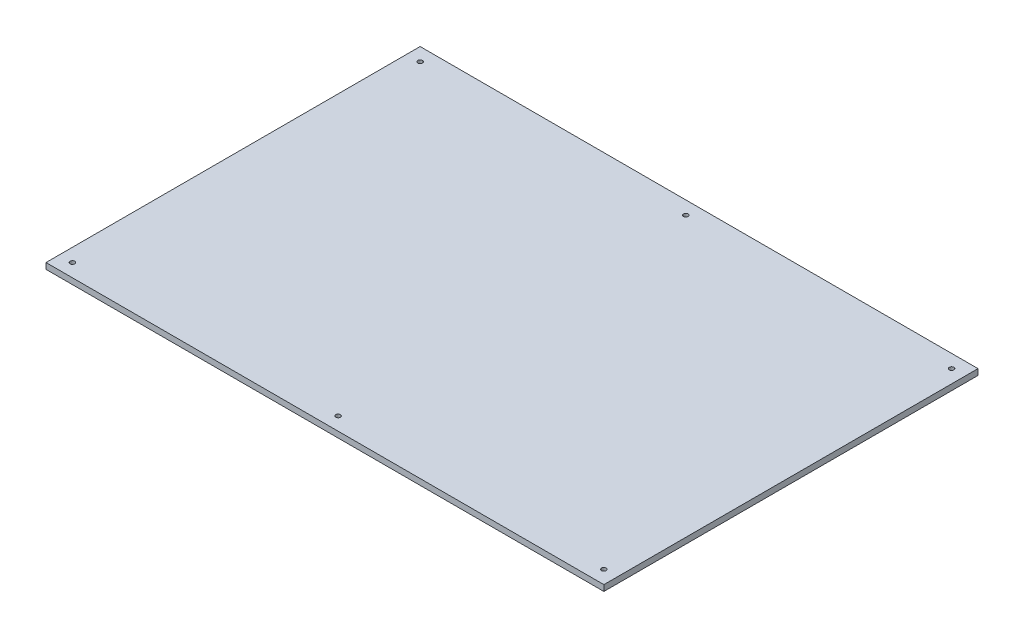
ISO-10303-21;
HEADER;
FILE_DESCRIPTION(('STEP AP214'),'2;1');
FILE_NAME('part.step','',(''),(''),'','','');
FILE_SCHEMA(('AUTOMOTIVE_DESIGN { 1 0 10303 214 1 1 1 1 }'));
ENDSEC;
DATA;
#1=APPLICATION_CONTEXT('core data for automotive mechanical design processes');
#2=APPLICATION_PROTOCOL_DEFINITION('international standard','automotive_design',2000,#1);
#3=PRODUCT_CONTEXT('',#1,'mechanical');
#4=PRODUCT('Part','Part','',(#3));
#5=PRODUCT_RELATED_PRODUCT_CATEGORY('part','',(#4));
#6=PRODUCT_DEFINITION_FORMATION('','',#4);
#7=PRODUCT_DEFINITION_CONTEXT('part definition',#1,'design');
#8=PRODUCT_DEFINITION('design','',#6,#7);
#9=PRODUCT_DEFINITION_SHAPE('','',#8);
#10=(LENGTH_UNIT() NAMED_UNIT(*) SI_UNIT(.MILLI.,.METRE.));
#11=(NAMED_UNIT(*) PLANE_ANGLE_UNIT() SI_UNIT($,.RADIAN.));
#12=(NAMED_UNIT(*) SI_UNIT($,.STERADIAN.) SOLID_ANGLE_UNIT());
#13=UNCERTAINTY_MEASURE_WITH_UNIT(LENGTH_MEASURE(1.E-05),#10,'distance_accuracy_value','');
#14=(GEOMETRIC_REPRESENTATION_CONTEXT(3) GLOBAL_UNCERTAINTY_ASSIGNED_CONTEXT((#13)) GLOBAL_UNIT_ASSIGNED_CONTEXT((#10,
#11,#12)) REPRESENTATION_CONTEXT('',''));
#15=CARTESIAN_POINT('',(0.,0.,0.));
#16=DIRECTION('',(0.,0.,1.));
#17=DIRECTION('',(1.,0.,0.));
#18=AXIS2_PLACEMENT_3D('',#15,#16,#17);
#19=CARTESIAN_POINT('',(0.,4.5,0.));
#20=DIRECTION('',(0.,1.,0.));
#21=DIRECTION('',(0.,0.,1.));
#22=AXIS2_PLACEMENT_3D('',#19,#20,#21);
#23=PLANE('',#22);
#24=CARTESIAN_POINT('',(201.,4.5,-131.5));
#25=DIRECTION('',(0.,-1.,0.));
#26=DIRECTION('',(0.,0.,1.));
#27=AXIS2_PLACEMENT_3D('',#24,#25,#26);
#28=CIRCLE('',#27,1.75000000000001);
#29=CARTESIAN_POINT('',(201.,4.5,-129.75));
#30=VERTEX_POINT('',#29);
#31=EDGE_CURVE('E138',#30,#30,#28,.T.);
#32=ORIENTED_EDGE('',*,*,#31,.T.);
#33=EDGE_LOOP('',(#32));
#34=FACE_BOUND('',#33,.T.);
#35=CARTESIAN_POINT('',(-201.,4.5,-131.5));
#36=DIRECTION('',(0.,1.,0.));
#37=DIRECTION('',(0.,0.,1.));
#38=AXIS2_PLACEMENT_3D('',#35,#36,#37);
#39=CIRCLE('',#38,1.75000000000001);
#40=CARTESIAN_POINT('',(-201.,4.5,-129.75));
#41=VERTEX_POINT('',#40);
#42=EDGE_CURVE('E133',#41,#41,#39,.T.);
#43=ORIENTED_EDGE('',*,*,#42,.F.);
#44=EDGE_LOOP('',(#43));
#45=FACE_BOUND('',#44,.T.);
#46=CARTESIAN_POINT('',(0.,4.5,-131.5));
#47=DIRECTION('',(0.,1.,0.));
#48=DIRECTION('',(0.,0.,1.));
#49=AXIS2_PLACEMENT_3D('',#46,#47,#48);
#50=CIRCLE('',#49,1.75);
#51=CARTESIAN_POINT('',(0.,4.5,-129.75));
#52=VERTEX_POINT('',#51);
#53=EDGE_CURVE('E134',#52,#52,#50,.T.);
#54=ORIENTED_EDGE('',*,*,#53,.F.);
#55=EDGE_LOOP('',(#54));
#56=FACE_BOUND('',#55,.T.);
#57=DIRECTION('',(0.,0.,1.));
#58=VECTOR('',#57,1.);
#59=CARTESIAN_POINT('',(-211.,4.5,141.5));
#60=LINE('',#59,#58);
#61=CARTESIAN_POINT('',(-211.,4.5,-141.5));
#62=VERTEX_POINT('',#61);
#63=CARTESIAN_POINT('',(-211.,4.5,141.5));
#64=VERTEX_POINT('',#63);
#65=EDGE_CURVE('E91',#62,#64,#60,.T.);
#66=ORIENTED_EDGE('',*,*,#65,.T.);
#67=DIRECTION('',(1.,0.,0.));
#68=VECTOR('',#67,1.);
#69=CARTESIAN_POINT('',(211.,4.5,141.5));
#70=LINE('',#69,#68);
#71=CARTESIAN_POINT('',(211.,4.5,141.5));
#72=VERTEX_POINT('',#71);
#73=EDGE_CURVE('E86',#64,#72,#70,.T.);
#74=ORIENTED_EDGE('',*,*,#73,.T.);
#75=DIRECTION('',(0.,0.,-1.));
#76=VECTOR('',#75,1.);
#77=CARTESIAN_POINT('',(211.,4.5,141.5));
#78=LINE('',#77,#76);
#79=CARTESIAN_POINT('',(211.,4.5,-141.5));
#80=VERTEX_POINT('',#79);
#81=EDGE_CURVE('E89',#72,#80,#78,.T.);
#82=ORIENTED_EDGE('',*,*,#81,.T.);
#83=DIRECTION('',(-1.,0.,0.));
#84=VECTOR('',#83,1.);
#85=CARTESIAN_POINT('',(211.,4.5,-141.5));
#86=LINE('',#85,#84);
#87=EDGE_CURVE('E56',#80,#62,#86,.T.);
#88=ORIENTED_EDGE('',*,*,#87,.T.);
#89=EDGE_LOOP('',(#66,#74,#82,#88));
#90=FACE_BOUND('',#89,.T.);
#91=CARTESIAN_POINT('',(0.,4.5,131.5));
#92=DIRECTION('',(0.,1.,0.));
#93=DIRECTION('',(0.,0.,-1.));
#94=AXIS2_PLACEMENT_3D('',#91,#92,#93);
#95=CIRCLE('',#94,1.75);
#96=CARTESIAN_POINT('',(0.,4.5,129.75));
#97=VERTEX_POINT('',#96);
#98=EDGE_CURVE('E158',#97,#97,#95,.T.);
#99=ORIENTED_EDGE('',*,*,#98,.F.);
#100=EDGE_LOOP('',(#99));
#101=FACE_BOUND('',#100,.T.);
#102=CARTESIAN_POINT('',(201.,4.5,131.5));
#103=DIRECTION('',(0.,1.,0.));
#104=DIRECTION('',(0.,0.,-1.));
#105=AXIS2_PLACEMENT_3D('',#102,#103,#104);
#106=CIRCLE('',#105,1.75000000000001);
#107=CARTESIAN_POINT('',(201.,4.5,129.75));
#108=VERTEX_POINT('',#107);
#109=EDGE_CURVE('E157',#108,#108,#106,.T.);
#110=ORIENTED_EDGE('',*,*,#109,.F.);
#111=EDGE_LOOP('',(#110));
#112=FACE_BOUND('',#111,.T.);
#113=CARTESIAN_POINT('',(-201.,4.5,131.5));
#114=DIRECTION('',(0.,-1.,0.));
#115=DIRECTION('',(0.,0.,-1.));
#116=AXIS2_PLACEMENT_3D('',#113,#114,#115);
#117=CIRCLE('',#116,1.75000000000001);
#118=CARTESIAN_POINT('',(-201.,4.5,129.75));
#119=VERTEX_POINT('',#118);
#120=EDGE_CURVE('E162',#119,#119,#117,.T.);
#121=ORIENTED_EDGE('',*,*,#120,.T.);
#122=EDGE_LOOP('',(#121));
#123=FACE_BOUND('',#122,.T.);
#124=ADVANCED_FACE('F38',(#34,#45,#56,#90,#101,#112,#123),#23,.T.);
#125=CARTESIAN_POINT('',(0.,0.,0.));
#126=DIRECTION('',(0.,1.,0.));
#127=DIRECTION('',(0.,0.,1.));
#128=AXIS2_PLACEMENT_3D('',#125,#126,#127);
#129=PLANE('',#128);
#130=CARTESIAN_POINT('',(201.,0.,131.5));
#131=DIRECTION('',(0.,1.,0.));
#132=DIRECTION('',(0.,0.,1.));
#133=AXIS2_PLACEMENT_3D('',#130,#131,#132);
#134=CIRCLE('',#133,1.75000000000001);
#135=CARTESIAN_POINT('',(201.,0.,133.25));
#136=VERTEX_POINT('',#135);
#137=EDGE_CURVE('E149',#136,#136,#134,.F.);
#138=ORIENTED_EDGE('',*,*,#137,.F.);
#139=EDGE_LOOP('',(#138));
#140=FACE_BOUND('',#139,.T.);
#141=CARTESIAN_POINT('',(0.,0.,131.5));
#142=DIRECTION('',(0.,1.,0.));
#143=DIRECTION('',(0.,0.,1.));
#144=AXIS2_PLACEMENT_3D('',#141,#142,#143);
#145=CIRCLE('',#144,1.75);
#146=CARTESIAN_POINT('',(0.,0.,133.25));
#147=VERTEX_POINT('',#146);
#148=EDGE_CURVE('E153',#147,#147,#145,.F.);
#149=ORIENTED_EDGE('',*,*,#148,.F.);
#150=EDGE_LOOP('',(#149));
#151=FACE_BOUND('',#150,.T.);
#152=CARTESIAN_POINT('',(-201.,0.,-131.5));
#153=DIRECTION('',(0.,1.,0.));
#154=DIRECTION('',(0.,0.,1.));
#155=AXIS2_PLACEMENT_3D('',#152,#153,#154);
#156=CIRCLE('',#155,1.75000000000001);
#157=CARTESIAN_POINT('',(-201.,0.,-129.75));
#158=VERTEX_POINT('',#157);
#159=EDGE_CURVE('E111',#158,#158,#156,.F.);
#160=ORIENTED_EDGE('',*,*,#159,.F.);
#161=EDGE_LOOP('',(#160));
#162=FACE_BOUND('',#161,.T.);
#163=CARTESIAN_POINT('',(0.,0.,-131.5));
#164=DIRECTION('',(0.,1.,0.));
#165=DIRECTION('',(0.,0.,1.));
#166=AXIS2_PLACEMENT_3D('',#163,#164,#165);
#167=CIRCLE('',#166,1.75);
#168=CARTESIAN_POINT('',(0.,0.,-129.75));
#169=VERTEX_POINT('',#168);
#170=EDGE_CURVE('E129',#169,#169,#167,.F.);
#171=ORIENTED_EDGE('',*,*,#170,.F.);
#172=EDGE_LOOP('',(#171));
#173=FACE_BOUND('',#172,.T.);
#174=DIRECTION('',(0.,0.,1.));
#175=VECTOR('',#174,1.);
#176=CARTESIAN_POINT('',(-211.,0.,141.5));
#177=LINE('',#176,#175);
#178=CARTESIAN_POINT('',(-211.,0.,-141.5));
#179=VERTEX_POINT('',#178);
#180=CARTESIAN_POINT('',(-211.,0.,141.5));
#181=VERTEX_POINT('',#180);
#182=EDGE_CURVE('E107',#179,#181,#177,.T.);
#183=ORIENTED_EDGE('',*,*,#182,.F.);
#184=DIRECTION('',(-1.,0.,0.));
#185=VECTOR('',#184,1.);
#186=CARTESIAN_POINT('',(211.,0.,-141.5));
#187=LINE('',#186,#185);
#188=CARTESIAN_POINT('',(211.,0.,-141.5));
#189=VERTEX_POINT('',#188);
#190=EDGE_CURVE('E79',#189,#179,#187,.T.);
#191=ORIENTED_EDGE('',*,*,#190,.F.);
#192=DIRECTION('',(0.,0.,-1.));
#193=VECTOR('',#192,1.);
#194=CARTESIAN_POINT('',(211.,0.,141.5));
#195=LINE('',#194,#193);
#196=CARTESIAN_POINT('',(211.,0.,141.5));
#197=VERTEX_POINT('',#196);
#198=EDGE_CURVE('E73',#197,#189,#195,.T.);
#199=ORIENTED_EDGE('',*,*,#198,.F.);
#200=DIRECTION('',(1.,0.,0.));
#201=VECTOR('',#200,1.);
#202=CARTESIAN_POINT('',(211.,0.,141.5));
#203=LINE('',#202,#201);
#204=EDGE_CURVE('E96',#181,#197,#203,.T.);
#205=ORIENTED_EDGE('',*,*,#204,.F.);
#206=EDGE_LOOP('',(#183,#191,#199,#205));
#207=FACE_BOUND('',#206,.T.);
#208=CARTESIAN_POINT('',(201.,0.,-131.5));
#209=DIRECTION('',(0.,1.,0.));
#210=DIRECTION('',(0.,0.,1.));
#211=AXIS2_PLACEMENT_3D('',#208,#209,#210);
#212=CIRCLE('',#211,1.75000000000001);
#213=CARTESIAN_POINT('',(201.,0.,-129.75));
#214=VERTEX_POINT('',#213);
#215=EDGE_CURVE('E145',#214,#214,#212,.T.);
#216=ORIENTED_EDGE('',*,*,#215,.T.);
#217=EDGE_LOOP('',(#216));
#218=FACE_BOUND('',#217,.T.);
#219=CARTESIAN_POINT('',(-201.,0.,131.5));
#220=DIRECTION('',(0.,1.,0.));
#221=DIRECTION('',(0.,0.,1.));
#222=AXIS2_PLACEMENT_3D('',#219,#220,#221);
#223=CIRCLE('',#222,1.75000000000001);
#224=CARTESIAN_POINT('',(-201.,0.,133.25));
#225=VERTEX_POINT('',#224);
#226=EDGE_CURVE('E169',#225,#225,#223,.T.);
#227=ORIENTED_EDGE('',*,*,#226,.T.);
#228=EDGE_LOOP('',(#227));
#229=FACE_BOUND('',#228,.T.);
#230=ADVANCED_FACE('F124',(#140,#151,#162,#173,#207,#218,#229),#129,.F.);
#231=CARTESIAN_POINT('',(-211.,4.5,141.5));
#232=DIRECTION('',(1.,0.,0.));
#233=DIRECTION('',(0.,0.,-1.));
#234=AXIS2_PLACEMENT_3D('',#231,#232,#233);
#235=PLANE('',#234);
#236=ORIENTED_EDGE('',*,*,#182,.T.);
#237=DIRECTION('',(0.,-1.,0.));
#238=VECTOR('',#237,1.);
#239=CARTESIAN_POINT('',(-211.,4.5,141.5));
#240=LINE('',#239,#238);
#241=EDGE_CURVE('E11',#64,#181,#240,.T.);
#242=ORIENTED_EDGE('',*,*,#241,.F.);
#243=ORIENTED_EDGE('',*,*,#65,.F.);
#244=DIRECTION('',(0.,-1.,0.));
#245=VECTOR('',#244,1.);
#246=CARTESIAN_POINT('',(-211.,4.5,-141.5));
#247=LINE('',#246,#245);
#248=EDGE_CURVE('E103',#62,#179,#247,.T.);
#249=ORIENTED_EDGE('',*,*,#248,.T.);
#250=EDGE_LOOP('',(#236,#242,#243,#249));
#251=FACE_BOUND('',#250,.T.);
#252=ADVANCED_FACE('F40',(#251),#235,.F.);
#253=CARTESIAN_POINT('',(211.,4.5,141.5));
#254=DIRECTION('',(0.,0.,-1.));
#255=DIRECTION('',(-1.,0.,0.));
#256=AXIS2_PLACEMENT_3D('',#253,#254,#255);
#257=PLANE('',#256);
#258=ORIENTED_EDGE('',*,*,#204,.T.);
#259=DIRECTION('',(0.,-1.,0.));
#260=VECTOR('',#259,1.);
#261=CARTESIAN_POINT('',(211.,4.5,141.5));
#262=LINE('',#261,#260);
#263=EDGE_CURVE('E48',#72,#197,#262,.T.);
#264=ORIENTED_EDGE('',*,*,#263,.F.);
#265=ORIENTED_EDGE('',*,*,#73,.F.);
#266=ORIENTED_EDGE('',*,*,#241,.T.);
#267=EDGE_LOOP('',(#258,#264,#265,#266));
#268=FACE_BOUND('',#267,.T.);
#269=ADVANCED_FACE('F95',(#268),#257,.F.);
#270=CARTESIAN_POINT('',(211.,4.5,141.5));
#271=DIRECTION('',(-1.,0.,0.));
#272=DIRECTION('',(0.,0.,1.));
#273=AXIS2_PLACEMENT_3D('',#270,#271,#272);
#274=PLANE('',#273);
#275=ORIENTED_EDGE('',*,*,#198,.T.);
#276=DIRECTION('',(0.,-1.,0.));
#277=VECTOR('',#276,1.);
#278=CARTESIAN_POINT('',(211.,4.5,-141.5));
#279=LINE('',#278,#277);
#280=EDGE_CURVE('E98',#80,#189,#279,.T.);
#281=ORIENTED_EDGE('',*,*,#280,.F.);
#282=ORIENTED_EDGE('',*,*,#81,.F.);
#283=ORIENTED_EDGE('',*,*,#263,.T.);
#284=EDGE_LOOP('',(#275,#281,#282,#283));
#285=FACE_BOUND('',#284,.T.);
#286=ADVANCED_FACE('F99',(#285),#274,.F.);
#287=CARTESIAN_POINT('',(211.,4.5,-141.5));
#288=DIRECTION('',(0.,0.,1.));
#289=DIRECTION('',(1.,0.,0.));
#290=AXIS2_PLACEMENT_3D('',#287,#288,#289);
#291=PLANE('',#290);
#292=ORIENTED_EDGE('',*,*,#190,.T.);
#293=ORIENTED_EDGE('',*,*,#248,.F.);
#294=ORIENTED_EDGE('',*,*,#87,.F.);
#295=ORIENTED_EDGE('',*,*,#280,.T.);
#296=EDGE_LOOP('',(#292,#293,#294,#295));
#297=FACE_BOUND('',#296,.T.);
#298=ADVANCED_FACE('F121',(#297),#291,.F.);
#299=CARTESIAN_POINT('',(0.,-0.00100000000000013,-131.5));
#300=DIRECTION('',(0.,1.,0.));
#301=DIRECTION('',(0.,0.,1.));
#302=AXIS2_PLACEMENT_3D('',#299,#300,#301);
#303=CYLINDRICAL_SURFACE('',#302,1.75);
#304=ORIENTED_EDGE('',*,*,#53,.T.);
#305=EDGE_LOOP('',(#304));
#306=FACE_BOUND('',#305,.T.);
#307=ORIENTED_EDGE('',*,*,#170,.T.);
#308=EDGE_LOOP('',(#307));
#309=FACE_BOUND('',#308,.T.);
#310=ADVANCED_FACE('F201',(#306,#309),#303,.F.);
#311=CARTESIAN_POINT('',(-201.,-0.00100000000000013,-131.5));
#312=DIRECTION('',(0.,1.,0.));
#313=DIRECTION('',(0.,0.,1.));
#314=AXIS2_PLACEMENT_3D('',#311,#312,#313);
#315=CYLINDRICAL_SURFACE('',#314,1.75000000000001);
#316=ORIENTED_EDGE('',*,*,#42,.T.);
#317=EDGE_LOOP('',(#316));
#318=FACE_BOUND('',#317,.T.);
#319=ORIENTED_EDGE('',*,*,#159,.T.);
#320=EDGE_LOOP('',(#319));
#321=FACE_BOUND('',#320,.T.);
#322=ADVANCED_FACE('F235',(#318,#321),#315,.F.);
#323=CARTESIAN_POINT('',(201.,-0.00100000000000013,-131.5));
#324=DIRECTION('',(0.,1.,0.));
#325=DIRECTION('',(0.,0.,1.));
#326=AXIS2_PLACEMENT_3D('',#323,#324,#325);
#327=CYLINDRICAL_SURFACE('',#326,1.75000000000001);
#328=ORIENTED_EDGE('',*,*,#31,.F.);
#329=EDGE_LOOP('',(#328));
#330=FACE_BOUND('',#329,.T.);
#331=ORIENTED_EDGE('',*,*,#215,.F.);
#332=EDGE_LOOP('',(#331));
#333=FACE_BOUND('',#332,.T.);
#334=ADVANCED_FACE('F242',(#330,#333),#327,.F.);
#335=CARTESIAN_POINT('',(0.,-0.00100000000000013,131.5));
#336=DIRECTION('',(0.,1.,0.));
#337=DIRECTION('',(0.,0.,1.));
#338=AXIS2_PLACEMENT_3D('',#335,#336,#337);
#339=CYLINDRICAL_SURFACE('',#338,1.75);
#340=ORIENTED_EDGE('',*,*,#98,.T.);
#341=EDGE_LOOP('',(#340));
#342=FACE_BOUND('',#341,.T.);
#343=ORIENTED_EDGE('',*,*,#148,.T.);
#344=EDGE_LOOP('',(#343));
#345=FACE_BOUND('',#344,.T.);
#346=ADVANCED_FACE('F249',(#342,#345),#339,.F.);
#347=CARTESIAN_POINT('',(201.,-0.00100000000000013,131.5));
#348=DIRECTION('',(0.,1.,0.));
#349=DIRECTION('',(0.,0.,1.));
#350=AXIS2_PLACEMENT_3D('',#347,#348,#349);
#351=CYLINDRICAL_SURFACE('',#350,1.75000000000001);
#352=ORIENTED_EDGE('',*,*,#109,.T.);
#353=EDGE_LOOP('',(#352));
#354=FACE_BOUND('',#353,.T.);
#355=ORIENTED_EDGE('',*,*,#137,.T.);
#356=EDGE_LOOP('',(#355));
#357=FACE_BOUND('',#356,.T.);
#358=ADVANCED_FACE('F181',(#354,#357),#351,.F.);
#359=CARTESIAN_POINT('',(-201.,-0.00100000000000013,131.5));
#360=DIRECTION('',(0.,1.,0.));
#361=DIRECTION('',(0.,0.,1.));
#362=AXIS2_PLACEMENT_3D('',#359,#360,#361);
#363=CYLINDRICAL_SURFACE('',#362,1.75000000000001);
#364=ORIENTED_EDGE('',*,*,#120,.F.);
#365=EDGE_LOOP('',(#364));
#366=FACE_BOUND('',#365,.T.);
#367=ORIENTED_EDGE('',*,*,#226,.F.);
#368=EDGE_LOOP('',(#367));
#369=FACE_BOUND('',#368,.T.);
#370=ADVANCED_FACE('F178',(#366,#369),#363,.F.);
#371=CLOSED_SHELL('',(#124,#230,#252,#269,#286,#298,#310,#322,#334,#346,#358,#370));
#372=MANIFOLD_SOLID_BREP('B2',#371);
#373=ADVANCED_BREP_SHAPE_REPRESENTATION('',(#18,#372),#14);
#374=SHAPE_DEFINITION_REPRESENTATION(#9,#373);
ENDSEC;
END-ISO-10303-21;
